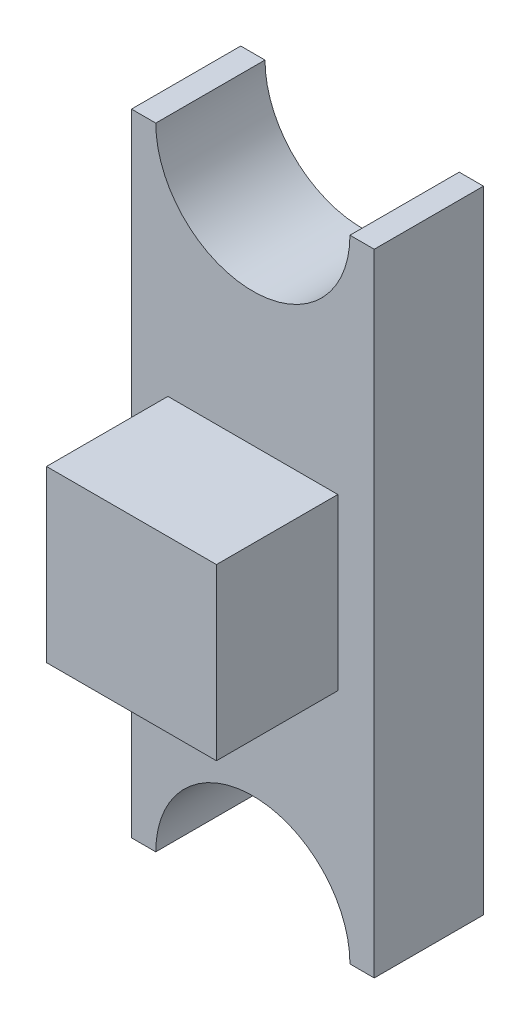
ISO-10303-21;
HEADER;
FILE_DESCRIPTION(('STEP AP214'),'2;1');
FILE_NAME('part.step','',(''),(''),'','','');
FILE_SCHEMA(('AUTOMOTIVE_DESIGN { 1 0 10303 214 1 1 1 1 }'));
ENDSEC;
DATA;
#1=APPLICATION_CONTEXT('core data for automotive mechanical design processes');
#2=APPLICATION_PROTOCOL_DEFINITION('international standard','automotive_design',2000,#1);
#3=PRODUCT_CONTEXT('',#1,'mechanical');
#4=PRODUCT('Part','Part','',(#3));
#5=PRODUCT_RELATED_PRODUCT_CATEGORY('part','',(#4));
#6=PRODUCT_DEFINITION_FORMATION('','',#4);
#7=PRODUCT_DEFINITION_CONTEXT('part definition',#1,'design');
#8=PRODUCT_DEFINITION('design','',#6,#7);
#9=PRODUCT_DEFINITION_SHAPE('','',#8);
#10=(LENGTH_UNIT() NAMED_UNIT(*) SI_UNIT(.MILLI.,.METRE.));
#11=(NAMED_UNIT(*) PLANE_ANGLE_UNIT() SI_UNIT($,.RADIAN.));
#12=(NAMED_UNIT(*) SI_UNIT($,.STERADIAN.) SOLID_ANGLE_UNIT());
#13=UNCERTAINTY_MEASURE_WITH_UNIT(LENGTH_MEASURE(1.E-05),#10,'distance_accuracy_value','');
#14=(GEOMETRIC_REPRESENTATION_CONTEXT(3) GLOBAL_UNCERTAINTY_ASSIGNED_CONTEXT((#13)) GLOBAL_UNIT_ASSIGNED_CONTEXT((#10,
#11,#12)) REPRESENTATION_CONTEXT('',''));
#15=CARTESIAN_POINT('',(0.,0.,0.));
#16=DIRECTION('',(0.,0.,1.));
#17=DIRECTION('',(1.,0.,0.));
#18=AXIS2_PLACEMENT_3D('',#15,#16,#17);
#19=CARTESIAN_POINT('',(0.5,0.,1.5));
#20=DIRECTION('',(0.,0.,-1.));
#21=DIRECTION('',(-1.,0.,0.));
#22=AXIS2_PLACEMENT_3D('',#19,#20,#21);
#23=PLANE('',#22);
#24=DIRECTION('',(1.,0.,0.));
#25=VECTOR('',#24,1.);
#26=CARTESIAN_POINT('',(0.5,-0.7,1.5));
#27=LINE('',#26,#25);
#28=CARTESIAN_POINT('',(-0.35,-0.7,1.5));
#29=VERTEX_POINT('',#28);
#30=CARTESIAN_POINT('',(0.35,-0.7,1.5));
#31=VERTEX_POINT('',#30);
#32=EDGE_CURVE('E202',#29,#31,#27,.T.);
#33=ORIENTED_EDGE('',*,*,#32,.T.);
#34=DIRECTION('',(0.,1.,0.));
#35=VECTOR('',#34,1.);
#36=CARTESIAN_POINT('',(0.35,-2.943212530552,1.5));
#37=LINE('',#36,#35);
#38=CARTESIAN_POINT('',(0.35,0.,1.5));
#39=VERTEX_POINT('',#38);
#40=EDGE_CURVE('E197',#31,#39,#37,.T.);
#41=ORIENTED_EDGE('',*,*,#40,.T.);
#42=DIRECTION('',(1.,0.,0.));
#43=VECTOR('',#42,1.);
#44=CARTESIAN_POINT('',(0.5,0.,1.5));
#45=LINE('',#44,#43);
#46=CARTESIAN_POINT('',(-0.35,0.,1.5));
#47=VERTEX_POINT('',#46);
#48=EDGE_CURVE('E192',#39,#47,#45,.F.);
#49=ORIENTED_EDGE('',*,*,#48,.T.);
#50=DIRECTION('',(0.,1.,0.));
#51=VECTOR('',#50,1.);
#52=CARTESIAN_POINT('',(-0.35,-2.943212530552,1.5));
#53=LINE('',#52,#51);
#54=EDGE_CURVE('E71',#29,#47,#53,.T.);
#55=ORIENTED_EDGE('',*,*,#54,.F.);
#56=EDGE_LOOP('',(#33,#41,#49,#55));
#57=FACE_BOUND('',#56,.T.);
#58=ADVANCED_FACE('F17',(#57),#23,.F.);
#59=CARTESIAN_POINT('',(0.5,-0.7,1.5));
#60=DIRECTION('',(0.,1.,0.));
#61=DIRECTION('',(0.,0.,1.));
#62=AXIS2_PLACEMENT_3D('',#59,#60,#61);
#63=PLANE('',#62);
#64=DIRECTION('',(-1.,0.,0.));
#65=VECTOR('',#64,1.);
#66=CARTESIAN_POINT('',(0.5,-0.7,1.));
#67=LINE('',#66,#65);
#68=CARTESIAN_POINT('',(-0.35,-0.7,1.));
#69=VERTEX_POINT('',#68);
#70=CARTESIAN_POINT('',(0.35,-0.7,1.));
#71=VERTEX_POINT('',#70);
#72=EDGE_CURVE('E172',#69,#71,#67,.F.);
#73=ORIENTED_EDGE('',*,*,#72,.T.);
#74=DIRECTION('',(0.,0.,1.));
#75=VECTOR('',#74,1.);
#76=CARTESIAN_POINT('',(0.35,-0.7,1.));
#77=LINE('',#76,#75);
#78=EDGE_CURVE('E199',#71,#31,#77,.T.);
#79=ORIENTED_EDGE('',*,*,#78,.T.);
#80=ORIENTED_EDGE('',*,*,#32,.F.);
#81=DIRECTION('',(0.,0.,1.));
#82=VECTOR('',#81,1.);
#83=CARTESIAN_POINT('',(-0.35,-0.7,1.));
#84=LINE('',#83,#82);
#85=EDGE_CURVE('E190',#69,#29,#84,.T.);
#86=ORIENTED_EDGE('',*,*,#85,.F.);
#87=EDGE_LOOP('',(#73,#79,#80,#86));
#88=FACE_BOUND('',#87,.T.);
#89=ADVANCED_FACE('F365',(#88),#63,.F.);
#90=CARTESIAN_POINT('',(0.35,-2.943212530552,1.));
#91=DIRECTION('',(-1.,0.,0.));
#92=DIRECTION('',(0.,0.,1.));
#93=AXIS2_PLACEMENT_3D('',#90,#91,#92);
#94=PLANE('',#93);
#95=DIRECTION('',(0.,0.,-1.));
#96=VECTOR('',#95,1.);
#97=CARTESIAN_POINT('',(0.35,0.,1.));
#98=LINE('',#97,#96);
#99=CARTESIAN_POINT('',(0.35,0.,1.));
#100=VERTEX_POINT('',#99);
#101=EDGE_CURVE('E194',#100,#39,#98,.F.);
#102=ORIENTED_EDGE('',*,*,#101,.T.);
#103=ORIENTED_EDGE('',*,*,#40,.F.);
#104=ORIENTED_EDGE('',*,*,#78,.F.);
#105=DIRECTION('',(0.,1.,0.));
#106=VECTOR('',#105,1.);
#107=CARTESIAN_POINT('',(0.35,-0.7,1.));
#108=LINE('',#107,#106);
#109=EDGE_CURVE('E169',#71,#100,#108,.T.);
#110=ORIENTED_EDGE('',*,*,#109,.T.);
#111=EDGE_LOOP('',(#102,#103,#104,#110));
#112=FACE_BOUND('',#111,.T.);
#113=ADVANCED_FACE('F356',(#112),#94,.F.);
#114=CARTESIAN_POINT('',(0.5,0.,1.));
#115=DIRECTION('',(0.,-1.,0.));
#116=DIRECTION('',(0.,0.,-1.));
#117=AXIS2_PLACEMENT_3D('',#114,#115,#116);
#118=PLANE('',#117);
#119=ORIENTED_EDGE('',*,*,#48,.F.);
#120=ORIENTED_EDGE('',*,*,#101,.F.);
#121=DIRECTION('',(-1.,0.,0.));
#122=VECTOR('',#121,1.);
#123=CARTESIAN_POINT('',(0.5,0.,1.));
#124=LINE('',#123,#122);
#125=CARTESIAN_POINT('',(-0.35,0.,1.));
#126=VERTEX_POINT('',#125);
#127=EDGE_CURVE('E166',#100,#126,#124,.T.);
#128=ORIENTED_EDGE('',*,*,#127,.T.);
#129=DIRECTION('',(0.,0.,1.));
#130=VECTOR('',#129,1.);
#131=CARTESIAN_POINT('',(-0.35,0.,1.));
#132=LINE('',#131,#130);
#133=EDGE_CURVE('E180',#47,#126,#132,.F.);
#134=ORIENTED_EDGE('',*,*,#133,.F.);
#135=EDGE_LOOP('',(#119,#120,#128,#134));
#136=FACE_BOUND('',#135,.T.);
#137=ADVANCED_FACE('F348',(#136),#118,.F.);
#138=CARTESIAN_POINT('',(-0.35,-2.943212530552,1.));
#139=DIRECTION('',(-1.,0.,0.));
#140=DIRECTION('',(0.,0.,1.));
#141=AXIS2_PLACEMENT_3D('',#138,#139,#140);
#142=PLANE('',#141);
#143=ORIENTED_EDGE('',*,*,#133,.T.);
#144=DIRECTION('',(0.,1.,0.));
#145=VECTOR('',#144,1.);
#146=CARTESIAN_POINT('',(-0.35,-0.7,1.));
#147=LINE('',#146,#145);
#148=EDGE_CURVE('E159',#126,#69,#147,.F.);
#149=ORIENTED_EDGE('',*,*,#148,.T.);
#150=ORIENTED_EDGE('',*,*,#85,.T.);
#151=ORIENTED_EDGE('',*,*,#54,.T.);
#152=EDGE_LOOP('',(#143,#149,#150,#151));
#153=FACE_BOUND('',#152,.T.);
#154=ADVANCED_FACE('F339',(#153),#142,.T.);
#155=CARTESIAN_POINT('',(0.5,-0.7,1.));
#156=DIRECTION('',(0.,0.,-1.));
#157=DIRECTION('',(-1.,0.,0.));
#158=AXIS2_PLACEMENT_3D('',#155,#156,#157);
#159=PLANE('',#158);
#160=ORIENTED_EDGE('',*,*,#127,.F.);
#161=ORIENTED_EDGE('',*,*,#109,.F.);
#162=ORIENTED_EDGE('',*,*,#72,.F.);
#163=ORIENTED_EDGE('',*,*,#148,.F.);
#164=EDGE_LOOP('',(#160,#161,#162,#163));
#165=FACE_BOUND('',#164,.T.);
#166=CARTESIAN_POINT('',(0.,-1.65,1.));
#167=DIRECTION('',(0.,0.,1.));
#168=DIRECTION('',(1.,0.,0.));
#169=AXIS2_PLACEMENT_3D('',#166,#167,#168);
#170=CIRCLE('',#169,0.4);
#171=CARTESIAN_POINT('',(0.4,-1.65,1.));
#172=VERTEX_POINT('',#171);
#173=CARTESIAN_POINT('',(-0.4,-1.65,1.));
#174=VERTEX_POINT('',#173);
#175=EDGE_CURVE('E20',#172,#174,#170,.T.);
#176=ORIENTED_EDGE('',*,*,#175,.F.);
#177=DIRECTION('',(-1.,0.,0.));
#178=VECTOR('',#177,1.);
#179=CARTESIAN_POINT('',(0.5,-1.65,1.));
#180=LINE('',#179,#178);
#181=CARTESIAN_POINT('',(0.5,-1.65,1.));
#182=VERTEX_POINT('',#181);
#183=EDGE_CURVE('E89',#182,#172,#180,.T.);
#184=ORIENTED_EDGE('',*,*,#183,.F.);
#185=DIRECTION('',(0.,1.,0.));
#186=VECTOR('',#185,1.);
#187=CARTESIAN_POINT('',(0.5,-1.65,1.));
#188=LINE('',#187,#186);
#189=CARTESIAN_POINT('',(0.5,0.95,1.));
#190=VERTEX_POINT('',#189);
#191=EDGE_CURVE('E155',#190,#182,#188,.F.);
#192=ORIENTED_EDGE('',*,*,#191,.F.);
#193=DIRECTION('',(1.,0.,0.));
#194=VECTOR('',#193,1.);
#195=CARTESIAN_POINT('',(0.5,0.95,1.));
#196=LINE('',#195,#194);
#197=CARTESIAN_POINT('',(0.4,0.95,1.));
#198=VERTEX_POINT('',#197);
#199=EDGE_CURVE('E151',#190,#198,#196,.F.);
#200=ORIENTED_EDGE('',*,*,#199,.T.);
#201=CARTESIAN_POINT('',(0.,0.95,1.));
#202=DIRECTION('',(0.,0.,1.));
#203=DIRECTION('',(1.,0.,0.));
#204=AXIS2_PLACEMENT_3D('',#201,#202,#203);
#205=CIRCLE('',#204,0.4);
#206=CARTESIAN_POINT('',(-0.4,0.95,1.));
#207=VERTEX_POINT('',#206);
#208=EDGE_CURVE('E123',#198,#207,#205,.F.);
#209=ORIENTED_EDGE('',*,*,#208,.T.);
#210=DIRECTION('',(1.,0.,0.));
#211=VECTOR('',#210,1.);
#212=CARTESIAN_POINT('',(0.5,0.95,1.));
#213=LINE('',#212,#211);
#214=CARTESIAN_POINT('',(-0.5,0.95,1.));
#215=VERTEX_POINT('',#214);
#216=EDGE_CURVE('E117',#207,#215,#213,.F.);
#217=ORIENTED_EDGE('',*,*,#216,.T.);
#218=DIRECTION('',(0.,1.,0.));
#219=VECTOR('',#218,1.);
#220=CARTESIAN_POINT('',(-0.5,-1.65,1.));
#221=LINE('',#220,#219);
#222=CARTESIAN_POINT('',(-0.5,-1.65,1.));
#223=VERTEX_POINT('',#222);
#224=EDGE_CURVE('E120',#215,#223,#221,.F.);
#225=ORIENTED_EDGE('',*,*,#224,.T.);
#226=DIRECTION('',(-1.,0.,0.));
#227=VECTOR('',#226,1.);
#228=CARTESIAN_POINT('',(0.5,-1.65,1.));
#229=LINE('',#228,#227);
#230=EDGE_CURVE('E175',#174,#223,#229,.T.);
#231=ORIENTED_EDGE('',*,*,#230,.F.);
#232=EDGE_LOOP('',(#176,#184,#192,#200,#209,#217,#225,#231));
#233=FACE_BOUND('',#232,.T.);
#234=ADVANCED_FACE('F119',(#165,#233),#159,.F.);
#235=CARTESIAN_POINT('',(0.5,-1.65,0.55));
#236=DIRECTION('',(1.,0.,0.));
#237=DIRECTION('',(0.,1.,0.));
#238=AXIS2_PLACEMENT_3D('',#235,#236,#237);
#239=PLANE('',#238);
#240=DIRECTION('',(0.,1.,0.));
#241=VECTOR('',#240,1.);
#242=CARTESIAN_POINT('',(0.5,-1.65,0.55));
#243=LINE('',#242,#241);
#244=CARTESIAN_POINT('',(0.5,-1.65,0.55));
#245=VERTEX_POINT('',#244);
#246=CARTESIAN_POINT('',(0.5,0.95,0.55));
#247=VERTEX_POINT('',#246);
#248=EDGE_CURVE('E96',#245,#247,#243,.T.);
#249=ORIENTED_EDGE('',*,*,#248,.T.);
#250=DIRECTION('',(0.,0.,-1.));
#251=VECTOR('',#250,1.);
#252=CARTESIAN_POINT('',(0.5,0.95,0.55));
#253=LINE('',#252,#251);
#254=EDGE_CURVE('E152',#247,#190,#253,.F.);
#255=ORIENTED_EDGE('',*,*,#254,.T.);
#256=ORIENTED_EDGE('',*,*,#191,.T.);
#257=DIRECTION('',(0.,0.,1.));
#258=VECTOR('',#257,1.);
#259=CARTESIAN_POINT('',(0.5,-1.65,1.));
#260=LINE('',#259,#258);
#261=EDGE_CURVE('E224',#182,#245,#260,.F.);
#262=ORIENTED_EDGE('',*,*,#261,.T.);
#263=EDGE_LOOP('',(#249,#255,#256,#262));
#264=FACE_BOUND('',#263,.T.);
#265=ADVANCED_FACE('F251',(#264),#239,.T.);
#266=CARTESIAN_POINT('',(0.5,0.95,0.55));
#267=DIRECTION('',(0.,-1.,0.));
#268=DIRECTION('',(0.,0.,-1.));
#269=AXIS2_PLACEMENT_3D('',#266,#267,#268);
#270=PLANE('',#269);
#271=DIRECTION('',(0.,0.,1.));
#272=VECTOR('',#271,1.);
#273=CARTESIAN_POINT('',(0.4,0.95,3.5));
#274=LINE('',#273,#272);
#275=CARTESIAN_POINT('',(0.4,0.95,0.55));
#276=VERTEX_POINT('',#275);
#277=EDGE_CURVE('E148',#276,#198,#274,.T.);
#278=ORIENTED_EDGE('',*,*,#277,.T.);
#279=ORIENTED_EDGE('',*,*,#199,.F.);
#280=ORIENTED_EDGE('',*,*,#254,.F.);
#281=DIRECTION('',(1.,0.,0.));
#282=VECTOR('',#281,1.);
#283=CARTESIAN_POINT('',(0.5,0.95,0.55));
#284=LINE('',#283,#282);
#285=EDGE_CURVE('E209',#247,#276,#284,.F.);
#286=ORIENTED_EDGE('',*,*,#285,.T.);
#287=EDGE_LOOP('',(#278,#279,#280,#286));
#288=FACE_BOUND('',#287,.T.);
#289=ADVANCED_FACE('F253',(#288),#270,.F.);
#290=CARTESIAN_POINT('',(0.,0.95,3.5));
#291=DIRECTION('',(0.,0.,1.));
#292=DIRECTION('',(1.,0.,0.));
#293=AXIS2_PLACEMENT_3D('',#290,#291,#292);
#294=CYLINDRICAL_SURFACE('',#293,0.4);
#295=ORIENTED_EDGE('',*,*,#208,.F.);
#296=ORIENTED_EDGE('',*,*,#277,.F.);
#297=CARTESIAN_POINT('',(0.,0.95,0.55));
#298=DIRECTION('',(0.,0.,1.));
#299=DIRECTION('',(1.,0.,0.));
#300=AXIS2_PLACEMENT_3D('',#297,#298,#299);
#301=CIRCLE('',#300,0.4);
#302=CARTESIAN_POINT('',(-0.4,0.95,0.55));
#303=VERTEX_POINT('',#302);
#304=EDGE_CURVE('E207',#276,#303,#301,.F.);
#305=ORIENTED_EDGE('',*,*,#304,.T.);
#306=DIRECTION('',(0.,0.,-1.));
#307=VECTOR('',#306,1.);
#308=CARTESIAN_POINT('',(-0.4,0.95,0.55));
#309=LINE('',#308,#307);
#310=EDGE_CURVE('E128',#303,#207,#309,.F.);
#311=ORIENTED_EDGE('',*,*,#310,.T.);
#312=EDGE_LOOP('',(#295,#296,#305,#311));
#313=FACE_BOUND('',#312,.T.);
#314=ADVANCED_FACE('F254',(#313),#294,.F.);
#315=CARTESIAN_POINT('',(0.5,0.95,0.55));
#316=DIRECTION('',(0.,-1.,0.));
#317=DIRECTION('',(0.,0.,-1.));
#318=AXIS2_PLACEMENT_3D('',#315,#316,#317);
#319=PLANE('',#318);
#320=ORIENTED_EDGE('',*,*,#310,.F.);
#321=DIRECTION('',(1.,0.,0.));
#322=VECTOR('',#321,1.);
#323=CARTESIAN_POINT('',(0.5,0.95,0.55));
#324=LINE('',#323,#322);
#325=CARTESIAN_POINT('',(-0.5,0.95,0.55));
#326=VERTEX_POINT('',#325);
#327=EDGE_CURVE('E139',#303,#326,#324,.F.);
#328=ORIENTED_EDGE('',*,*,#327,.T.);
#329=DIRECTION('',(0.,0.,1.));
#330=VECTOR('',#329,1.);
#331=CARTESIAN_POINT('',(-0.5,0.95,0.55));
#332=LINE('',#331,#330);
#333=EDGE_CURVE('E127',#326,#215,#332,.T.);
#334=ORIENTED_EDGE('',*,*,#333,.T.);
#335=ORIENTED_EDGE('',*,*,#216,.F.);
#336=EDGE_LOOP('',(#320,#328,#334,#335));
#337=FACE_BOUND('',#336,.T.);
#338=ADVANCED_FACE('F137',(#337),#319,.F.);
#339=CARTESIAN_POINT('',(-0.5,-1.65,0.55));
#340=DIRECTION('',(1.,0.,0.));
#341=DIRECTION('',(0.,1.,0.));
#342=AXIS2_PLACEMENT_3D('',#339,#340,#341);
#343=PLANE('',#342);
#344=ORIENTED_EDGE('',*,*,#333,.F.);
#345=DIRECTION('',(0.,1.,0.));
#346=VECTOR('',#345,1.);
#347=CARTESIAN_POINT('',(-0.5,-1.65,0.55));
#348=LINE('',#347,#346);
#349=CARTESIAN_POINT('',(-0.5,-1.65,0.55));
#350=VERTEX_POINT('',#349);
#351=EDGE_CURVE('E212',#326,#350,#348,.F.);
#352=ORIENTED_EDGE('',*,*,#351,.T.);
#353=DIRECTION('',(0.,0.,1.));
#354=VECTOR('',#353,1.);
#355=CARTESIAN_POINT('',(-0.5,-1.65,1.));
#356=LINE('',#355,#354);
#357=EDGE_CURVE('E134',#350,#223,#356,.T.);
#358=ORIENTED_EDGE('',*,*,#357,.T.);
#359=ORIENTED_EDGE('',*,*,#224,.F.);
#360=EDGE_LOOP('',(#344,#352,#358,#359));
#361=FACE_BOUND('',#360,.T.);
#362=ADVANCED_FACE('F131',(#361),#343,.F.);
#363=CARTESIAN_POINT('',(0.5,-1.65,1.));
#364=DIRECTION('',(0.,1.,0.));
#365=DIRECTION('',(0.,0.,1.));
#366=AXIS2_PLACEMENT_3D('',#363,#364,#365);
#367=PLANE('',#366);
#368=DIRECTION('',(0.,0.,1.));
#369=VECTOR('',#368,1.);
#370=CARTESIAN_POINT('',(-0.4,-1.65,3.5));
#371=LINE('',#370,#369);
#372=CARTESIAN_POINT('',(-0.4,-1.65,0.55));
#373=VERTEX_POINT('',#372);
#374=EDGE_CURVE('E226',#373,#174,#371,.T.);
#375=ORIENTED_EDGE('',*,*,#374,.T.);
#376=ORIENTED_EDGE('',*,*,#230,.T.);
#377=ORIENTED_EDGE('',*,*,#357,.F.);
#378=DIRECTION('',(1.,0.,0.));
#379=VECTOR('',#378,1.);
#380=CARTESIAN_POINT('',(0.5,-1.65,0.55));
#381=LINE('',#380,#379);
#382=EDGE_CURVE('E206',#350,#373,#381,.T.);
#383=ORIENTED_EDGE('',*,*,#382,.T.);
#384=EDGE_LOOP('',(#375,#376,#377,#383));
#385=FACE_BOUND('',#384,.T.);
#386=ADVANCED_FACE('F243',(#385),#367,.F.);
#387=CARTESIAN_POINT('',(0.,-1.65,3.5));
#388=DIRECTION('',(0.,0.,1.));
#389=DIRECTION('',(1.,0.,0.));
#390=AXIS2_PLACEMENT_3D('',#387,#388,#389);
#391=CYLINDRICAL_SURFACE('',#390,0.4);
#392=ORIENTED_EDGE('',*,*,#175,.T.);
#393=ORIENTED_EDGE('',*,*,#374,.F.);
#394=CARTESIAN_POINT('',(0.,-1.65,0.55));
#395=DIRECTION('',(0.,0.,1.));
#396=DIRECTION('',(1.,0.,0.));
#397=AXIS2_PLACEMENT_3D('',#394,#395,#396);
#398=CIRCLE('',#397,0.4);
#399=CARTESIAN_POINT('',(0.4,-1.65,0.55));
#400=VERTEX_POINT('',#399);
#401=EDGE_CURVE('E26',#373,#400,#398,.F.);
#402=ORIENTED_EDGE('',*,*,#401,.T.);
#403=DIRECTION('',(0.,0.,1.));
#404=VECTOR('',#403,1.);
#405=CARTESIAN_POINT('',(0.4,-1.65,1.));
#406=LINE('',#405,#404);
#407=EDGE_CURVE('E34',#400,#172,#406,.T.);
#408=ORIENTED_EDGE('',*,*,#407,.T.);
#409=EDGE_LOOP('',(#392,#393,#402,#408));
#410=FACE_BOUND('',#409,.T.);
#411=ADVANCED_FACE('F247',(#410),#391,.F.);
#412=CARTESIAN_POINT('',(0.5,-1.65,1.));
#413=DIRECTION('',(0.,1.,0.));
#414=DIRECTION('',(0.,0.,1.));
#415=AXIS2_PLACEMENT_3D('',#412,#413,#414);
#416=PLANE('',#415);
#417=ORIENTED_EDGE('',*,*,#407,.F.);
#418=DIRECTION('',(1.,0.,0.));
#419=VECTOR('',#418,1.);
#420=CARTESIAN_POINT('',(0.5,-1.65,0.55));
#421=LINE('',#420,#419);
#422=EDGE_CURVE('E11',#400,#245,#421,.T.);
#423=ORIENTED_EDGE('',*,*,#422,.T.);
#424=ORIENTED_EDGE('',*,*,#261,.F.);
#425=ORIENTED_EDGE('',*,*,#183,.T.);
#426=EDGE_LOOP('',(#417,#423,#424,#425));
#427=FACE_BOUND('',#426,.T.);
#428=ADVANCED_FACE('F249',(#427),#416,.F.);
#429=CARTESIAN_POINT('',(0.5,-1.65,0.55));
#430=DIRECTION('',(0.,0.,1.));
#431=DIRECTION('',(1.,0.,0.));
#432=AXIS2_PLACEMENT_3D('',#429,#430,#431);
#433=PLANE('',#432);
#434=ORIENTED_EDGE('',*,*,#401,.F.);
#435=ORIENTED_EDGE('',*,*,#382,.F.);
#436=ORIENTED_EDGE('',*,*,#351,.F.);
#437=ORIENTED_EDGE('',*,*,#327,.F.);
#438=ORIENTED_EDGE('',*,*,#304,.F.);
#439=ORIENTED_EDGE('',*,*,#285,.F.);
#440=ORIENTED_EDGE('',*,*,#248,.F.);
#441=ORIENTED_EDGE('',*,*,#422,.F.);
#442=EDGE_LOOP('',(#434,#435,#436,#437,#438,#439,#440,#441));
#443=FACE_BOUND('',#442,.T.);
#444=ADVANCED_FACE('F245',(#443),#433,.F.);
#445=CLOSED_SHELL('',(#58,#89,#113,#137,#154,#234,#265,#289,#314,#338,#362,#386,#411,#428,#444));
#446=MANIFOLD_SOLID_BREP('B1',#445);
#447=ADVANCED_BREP_SHAPE_REPRESENTATION('',(#18,#446),#14);
#448=SHAPE_DEFINITION_REPRESENTATION(#9,#447);
ENDSEC;
END-ISO-10303-21;
